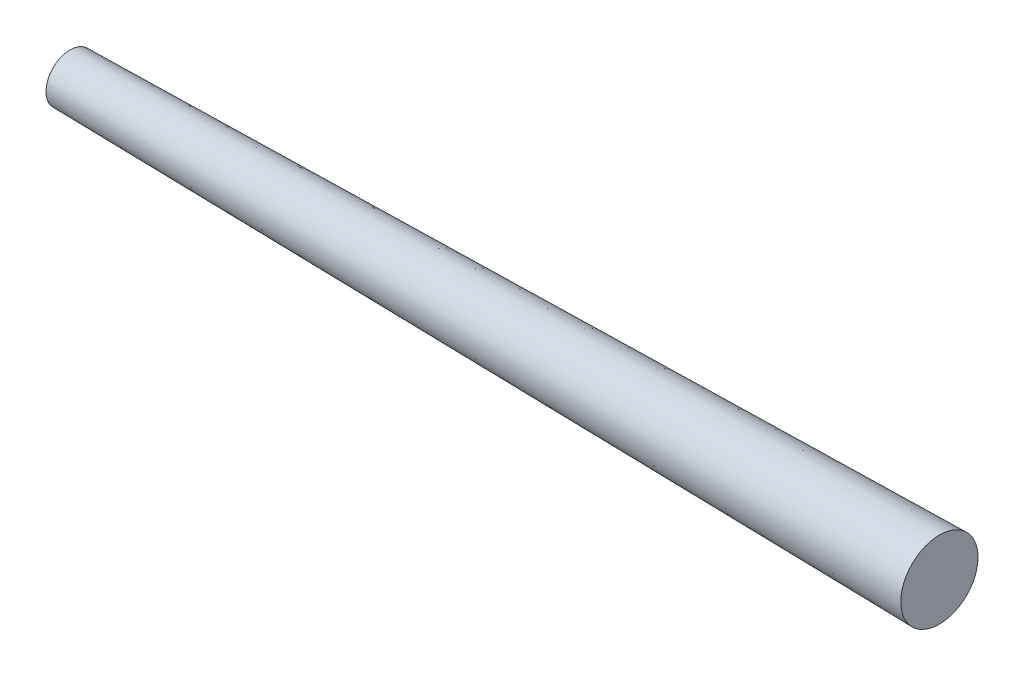
ISO-10303-21;
HEADER;
FILE_DESCRIPTION(('STEP AP214'),'2;1');
FILE_NAME('part.step','',(''),(''),'','','');
FILE_SCHEMA(('AUTOMOTIVE_DESIGN { 1 0 10303 214 1 1 1 1 }'));
ENDSEC;
DATA;
#1=APPLICATION_CONTEXT('core data for automotive mechanical design processes');
#2=APPLICATION_PROTOCOL_DEFINITION('international standard','automotive_design',2000,#1);
#3=PRODUCT_CONTEXT('',#1,'mechanical');
#4=PRODUCT('Part','Part','',(#3));
#5=PRODUCT_RELATED_PRODUCT_CATEGORY('part','',(#4));
#6=PRODUCT_DEFINITION_FORMATION('','',#4);
#7=PRODUCT_DEFINITION_CONTEXT('part definition',#1,'design');
#8=PRODUCT_DEFINITION('design','',#6,#7);
#9=PRODUCT_DEFINITION_SHAPE('','',#8);
#10=(LENGTH_UNIT() NAMED_UNIT(*) SI_UNIT(.MILLI.,.METRE.));
#11=(NAMED_UNIT(*) PLANE_ANGLE_UNIT() SI_UNIT($,.RADIAN.));
#12=(NAMED_UNIT(*) SI_UNIT($,.STERADIAN.) SOLID_ANGLE_UNIT());
#13=UNCERTAINTY_MEASURE_WITH_UNIT(LENGTH_MEASURE(1.E-05),#10,'distance_accuracy_value','');
#14=(GEOMETRIC_REPRESENTATION_CONTEXT(3) GLOBAL_UNCERTAINTY_ASSIGNED_CONTEXT((#13)) GLOBAL_UNIT_ASSIGNED_CONTEXT((#10,
#11,#12)) REPRESENTATION_CONTEXT('',''));
#15=CARTESIAN_POINT('',(0.,0.,0.));
#16=DIRECTION('',(0.,0.,1.));
#17=DIRECTION('',(1.,0.,0.));
#18=AXIS2_PLACEMENT_3D('',#15,#16,#17);
#19=CARTESIAN_POINT('',(-10.5382343550447,0.,0.));
#20=DIRECTION('',(-1.,0.,0.));
#21=DIRECTION('',(0.,-1.,0.));
#22=AXIS2_PLACEMENT_3D('',#19,#20,#21);
#23=PLANE('',#22);
#24=CARTESIAN_POINT('',(-10.5382343550447,0.,0.));
#25=DIRECTION('',(1.,0.,0.));
#26=DIRECTION('',(0.,1.,0.));
#27=AXIS2_PLACEMENT_3D('',#24,#25,#26);
#28=CIRCLE('',#27,2.5);
#29=CARTESIAN_POINT('',(-10.5382343550447,2.5,0.));
#30=VERTEX_POINT('',#29);
#31=EDGE_CURVE('E10',#30,#30,#28,.T.);
#32=ORIENTED_EDGE('',*,*,#31,.F.);
#33=EDGE_LOOP('',(#32));
#34=FACE_BOUND('',#33,.T.);
#35=ADVANCED_FACE('F31',(#34),#23,.T.);
#36=CARTESIAN_POINT('',(79.4617656449553,0.,0.));
#37=DIRECTION('',(1.,0.,0.));
#38=DIRECTION('',(0.,1.,0.));
#39=AXIS2_PLACEMENT_3D('',#36,#37,#38);
#40=CONICAL_SURFACE('',#39,4.,0.0166651237139408);
#41=ORIENTED_EDGE('',*,*,#31,.T.);
#42=EDGE_LOOP('',(#41));
#43=FACE_BOUND('',#42,.T.);
#44=CARTESIAN_POINT('',(79.4617656449553,0.,0.));
#45=DIRECTION('',(1.,0.,0.));
#46=DIRECTION('',(0.,1.,0.));
#47=AXIS2_PLACEMENT_3D('',#44,#45,#46);
#48=CIRCLE('',#47,4.);
#49=CARTESIAN_POINT('',(79.4617656449553,4.00000000000001,0.));
#50=VERTEX_POINT('',#49);
#51=EDGE_CURVE('E37',#50,#50,#48,.T.);
#52=ORIENTED_EDGE('',*,*,#51,.F.);
#53=EDGE_LOOP('',(#52));
#54=FACE_BOUND('',#53,.T.);
#55=ADVANCED_FACE('F45',(#43,#54),#40,.T.);
#56=CARTESIAN_POINT('',(79.4617656449553,4.00000000000001,0.));
#57=DIRECTION('',(1.,0.,0.));
#58=DIRECTION('',(0.,1.,0.));
#59=AXIS2_PLACEMENT_3D('',#56,#57,#58);
#60=PLANE('',#59);
#61=ORIENTED_EDGE('',*,*,#51,.T.);
#62=EDGE_LOOP('',(#61));
#63=FACE_BOUND('',#62,.T.);
#64=ADVANCED_FACE('F43',(#63),#60,.T.);
#65=CLOSED_SHELL('',(#35,#55,#64));
#66=MANIFOLD_SOLID_BREP('B2',#65);
#67=ADVANCED_BREP_SHAPE_REPRESENTATION('',(#18,#66),#14);
#68=SHAPE_DEFINITION_REPRESENTATION(#9,#67);
ENDSEC;
END-ISO-10303-21;
